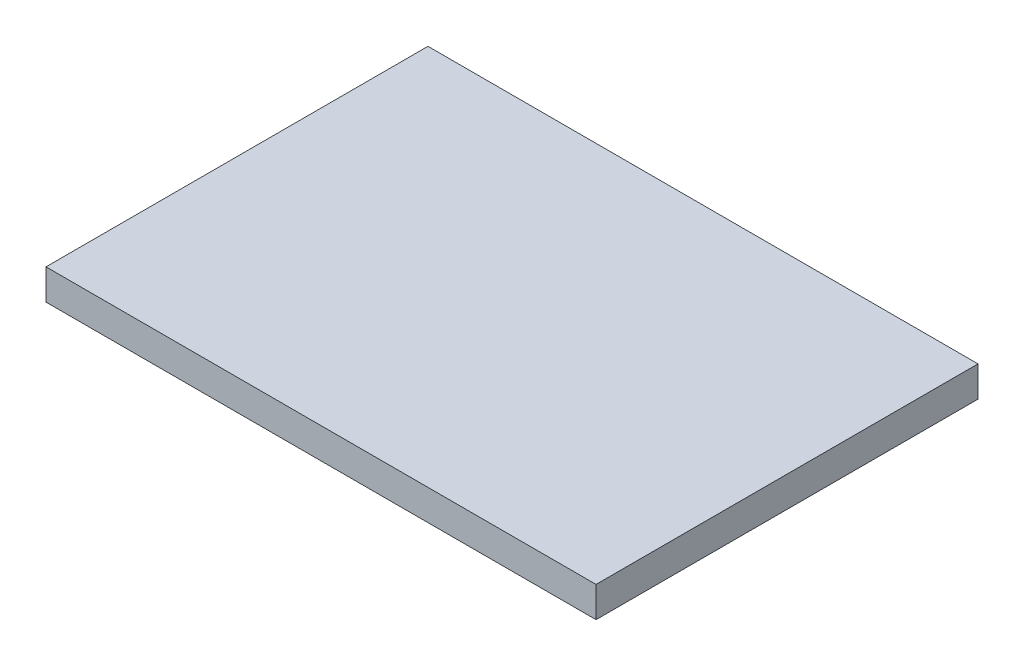
ISO-10303-21;
HEADER;
FILE_DESCRIPTION(('STEP AP214'),'2;1');
FILE_NAME('part.step','',(''),(''),'','','');
FILE_SCHEMA(('AUTOMOTIVE_DESIGN { 1 0 10303 214 1 1 1 1 }'));
ENDSEC;
DATA;
#1=APPLICATION_CONTEXT('core data for automotive mechanical design processes');
#2=APPLICATION_PROTOCOL_DEFINITION('international standard','automotive_design',2000,#1);
#3=PRODUCT_CONTEXT('',#1,'mechanical');
#4=PRODUCT('Part','Part','',(#3));
#5=PRODUCT_RELATED_PRODUCT_CATEGORY('part','',(#4));
#6=PRODUCT_DEFINITION_FORMATION('','',#4);
#7=PRODUCT_DEFINITION_CONTEXT('part definition',#1,'design');
#8=PRODUCT_DEFINITION('design','',#6,#7);
#9=PRODUCT_DEFINITION_SHAPE('','',#8);
#10=(LENGTH_UNIT() NAMED_UNIT(*) SI_UNIT(.MILLI.,.METRE.));
#11=(NAMED_UNIT(*) PLANE_ANGLE_UNIT() SI_UNIT($,.RADIAN.));
#12=(NAMED_UNIT(*) SI_UNIT($,.STERADIAN.) SOLID_ANGLE_UNIT());
#13=UNCERTAINTY_MEASURE_WITH_UNIT(LENGTH_MEASURE(1.E-05),#10,'distance_accuracy_value','');
#14=(GEOMETRIC_REPRESENTATION_CONTEXT(3) GLOBAL_UNCERTAINTY_ASSIGNED_CONTEXT((#13)) GLOBAL_UNIT_ASSIGNED_CONTEXT((#10,
#11,#12)) REPRESENTATION_CONTEXT('',''));
#15=CARTESIAN_POINT('',(0.,0.,0.));
#16=DIRECTION('',(0.,0.,1.));
#17=DIRECTION('',(1.,0.,0.));
#18=AXIS2_PLACEMENT_3D('',#15,#16,#17);
#19=CARTESIAN_POINT('',(18.,2.,-12.5));
#20=DIRECTION('',(-1.,0.,0.));
#21=DIRECTION('',(0.,0.,1.));
#22=AXIS2_PLACEMENT_3D('',#19,#20,#21);
#23=PLANE('',#22);
#24=DIRECTION('',(0.,0.,-1.));
#25=VECTOR('',#24,1.);
#26=CARTESIAN_POINT('',(18.,0.,-12.5));
#27=LINE('',#26,#25);
#28=CARTESIAN_POINT('',(18.,0.,12.5));
#29=VERTEX_POINT('',#28);
#30=CARTESIAN_POINT('',(18.,0.,-12.5));
#31=VERTEX_POINT('',#30);
#32=EDGE_CURVE('E98',#29,#31,#27,.T.);
#33=ORIENTED_EDGE('',*,*,#32,.T.);
#34=DIRECTION('',(0.,-1.,0.));
#35=VECTOR('',#34,1.);
#36=CARTESIAN_POINT('',(18.,2.,-12.5));
#37=LINE('',#36,#35);
#38=CARTESIAN_POINT('',(18.,2.,-12.5));
#39=VERTEX_POINT('',#38);
#40=EDGE_CURVE('E11',#39,#31,#37,.T.);
#41=ORIENTED_EDGE('',*,*,#40,.F.);
#42=DIRECTION('',(0.,0.,-1.));
#43=VECTOR('',#42,1.);
#44=CARTESIAN_POINT('',(18.,2.,-12.5));
#45=LINE('',#44,#43);
#46=CARTESIAN_POINT('',(18.,2.,12.5));
#47=VERTEX_POINT('',#46);
#48=EDGE_CURVE('E86',#47,#39,#45,.T.);
#49=ORIENTED_EDGE('',*,*,#48,.F.);
#50=DIRECTION('',(0.,-1.,0.));
#51=VECTOR('',#50,1.);
#52=CARTESIAN_POINT('',(18.,2.,12.5));
#53=LINE('',#52,#51);
#54=EDGE_CURVE('E94',#47,#29,#53,.T.);
#55=ORIENTED_EDGE('',*,*,#54,.T.);
#56=EDGE_LOOP('',(#33,#41,#49,#55));
#57=FACE_BOUND('',#56,.T.);
#58=ADVANCED_FACE('F35',(#57),#23,.F.);
#59=CARTESIAN_POINT('',(-18.,2.,-12.5));
#60=DIRECTION('',(0.,0.,1.));
#61=DIRECTION('',(1.,0.,0.));
#62=AXIS2_PLACEMENT_3D('',#59,#60,#61);
#63=PLANE('',#62);
#64=DIRECTION('',(-1.,0.,0.));
#65=VECTOR('',#64,1.);
#66=CARTESIAN_POINT('',(-18.,0.,-12.5));
#67=LINE('',#66,#65);
#68=CARTESIAN_POINT('',(-18.,0.,-12.5));
#69=VERTEX_POINT('',#68);
#70=EDGE_CURVE('E90',#31,#69,#67,.T.);
#71=ORIENTED_EDGE('',*,*,#70,.T.);
#72=DIRECTION('',(0.,-1.,0.));
#73=VECTOR('',#72,1.);
#74=CARTESIAN_POINT('',(-18.,2.,-12.5));
#75=LINE('',#74,#73);
#76=CARTESIAN_POINT('',(-18.,2.,-12.5));
#77=VERTEX_POINT('',#76);
#78=EDGE_CURVE('E43',#77,#69,#75,.T.);
#79=ORIENTED_EDGE('',*,*,#78,.F.);
#80=DIRECTION('',(-1.,0.,0.));
#81=VECTOR('',#80,1.);
#82=CARTESIAN_POINT('',(-18.,2.,-12.5));
#83=LINE('',#82,#81);
#84=EDGE_CURVE('E81',#39,#77,#83,.T.);
#85=ORIENTED_EDGE('',*,*,#84,.F.);
#86=ORIENTED_EDGE('',*,*,#40,.T.);
#87=EDGE_LOOP('',(#71,#79,#85,#86));
#88=FACE_BOUND('',#87,.T.);
#89=ADVANCED_FACE('F89',(#88),#63,.F.);
#90=CARTESIAN_POINT('',(-18.,2.,-12.5));
#91=DIRECTION('',(1.,0.,0.));
#92=DIRECTION('',(0.,0.,-1.));
#93=AXIS2_PLACEMENT_3D('',#90,#91,#92);
#94=PLANE('',#93);
#95=DIRECTION('',(0.,0.,1.));
#96=VECTOR('',#95,1.);
#97=CARTESIAN_POINT('',(-18.,0.,-12.5));
#98=LINE('',#97,#96);
#99=CARTESIAN_POINT('',(-18.,0.,12.5));
#100=VERTEX_POINT('',#99);
#101=EDGE_CURVE('E68',#69,#100,#98,.T.);
#102=ORIENTED_EDGE('',*,*,#101,.T.);
#103=DIRECTION('',(0.,-1.,0.));
#104=VECTOR('',#103,1.);
#105=CARTESIAN_POINT('',(-18.,2.,12.5));
#106=LINE('',#105,#104);
#107=CARTESIAN_POINT('',(-18.,2.,12.5));
#108=VERTEX_POINT('',#107);
#109=EDGE_CURVE('E91',#108,#100,#106,.T.);
#110=ORIENTED_EDGE('',*,*,#109,.F.);
#111=DIRECTION('',(0.,0.,1.));
#112=VECTOR('',#111,1.);
#113=CARTESIAN_POINT('',(-18.,2.,-12.5));
#114=LINE('',#113,#112);
#115=EDGE_CURVE('E84',#77,#108,#114,.T.);
#116=ORIENTED_EDGE('',*,*,#115,.F.);
#117=ORIENTED_EDGE('',*,*,#78,.T.);
#118=EDGE_LOOP('',(#102,#110,#116,#117));
#119=FACE_BOUND('',#118,.T.);
#120=ADVANCED_FACE('F92',(#119),#94,.F.);
#121=CARTESIAN_POINT('',(-18.,2.,12.5));
#122=DIRECTION('',(0.,0.,-1.));
#123=DIRECTION('',(-1.,0.,0.));
#124=AXIS2_PLACEMENT_3D('',#121,#122,#123);
#125=PLANE('',#124);
#126=DIRECTION('',(1.,0.,0.));
#127=VECTOR('',#126,1.);
#128=CARTESIAN_POINT('',(-18.,0.,12.5));
#129=LINE('',#128,#127);
#130=EDGE_CURVE('E74',#100,#29,#129,.T.);
#131=ORIENTED_EDGE('',*,*,#130,.T.);
#132=ORIENTED_EDGE('',*,*,#54,.F.);
#133=DIRECTION('',(1.,0.,0.));
#134=VECTOR('',#133,1.);
#135=CARTESIAN_POINT('',(-18.,2.,12.5));
#136=LINE('',#135,#134);
#137=EDGE_CURVE('E51',#108,#47,#136,.T.);
#138=ORIENTED_EDGE('',*,*,#137,.F.);
#139=ORIENTED_EDGE('',*,*,#109,.T.);
#140=EDGE_LOOP('',(#131,#132,#138,#139));
#141=FACE_BOUND('',#140,.T.);
#142=ADVANCED_FACE('F105',(#141),#125,.F.);
#143=CARTESIAN_POINT('',(0.,2.,0.));
#144=DIRECTION('',(0.,1.,0.));
#145=DIRECTION('',(0.,0.,1.));
#146=AXIS2_PLACEMENT_3D('',#143,#144,#145);
#147=PLANE('',#146);
#148=ORIENTED_EDGE('',*,*,#48,.T.);
#149=ORIENTED_EDGE('',*,*,#84,.T.);
#150=ORIENTED_EDGE('',*,*,#115,.T.);
#151=ORIENTED_EDGE('',*,*,#137,.T.);
#152=EDGE_LOOP('',(#148,#149,#150,#151));
#153=FACE_BOUND('',#152,.T.);
#154=ADVANCED_FACE('F82',(#153),#147,.T.);
#155=CARTESIAN_POINT('',(0.,0.,0.));
#156=DIRECTION('',(0.,1.,0.));
#157=DIRECTION('',(0.,0.,1.));
#158=AXIS2_PLACEMENT_3D('',#155,#156,#157);
#159=PLANE('',#158);
#160=ORIENTED_EDGE('',*,*,#32,.F.);
#161=ORIENTED_EDGE('',*,*,#130,.F.);
#162=ORIENTED_EDGE('',*,*,#101,.F.);
#163=ORIENTED_EDGE('',*,*,#70,.F.);
#164=EDGE_LOOP('',(#160,#161,#162,#163));
#165=FACE_BOUND('',#164,.T.);
#166=ADVANCED_FACE('F108',(#165),#159,.F.);
#167=CLOSED_SHELL('',(#58,#89,#120,#142,#154,#166));
#168=MANIFOLD_SOLID_BREP('B2',#167);
#169=ADVANCED_BREP_SHAPE_REPRESENTATION('',(#18,#168),#14);
#170=SHAPE_DEFINITION_REPRESENTATION(#9,#169);
ENDSEC;
END-ISO-10303-21;
